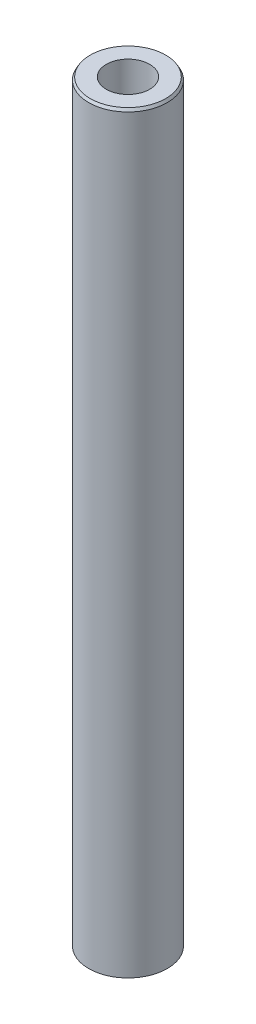
ISO-10303-21;
HEADER;
FILE_DESCRIPTION(('STEP AP214'),'2;1');
FILE_NAME('part.step','',(''),(''),'','','');
FILE_SCHEMA(('AUTOMOTIVE_DESIGN { 1 0 10303 214 1 1 1 1 }'));
ENDSEC;
DATA;
#1=APPLICATION_CONTEXT('core data for automotive mechanical design processes');
#2=APPLICATION_PROTOCOL_DEFINITION('international standard','automotive_design',2000,#1);
#3=PRODUCT_CONTEXT('',#1,'mechanical');
#4=PRODUCT('Part','Part','',(#3));
#5=PRODUCT_RELATED_PRODUCT_CATEGORY('part','',(#4));
#6=PRODUCT_DEFINITION_FORMATION('','',#4);
#7=PRODUCT_DEFINITION_CONTEXT('part definition',#1,'design');
#8=PRODUCT_DEFINITION('design','',#6,#7);
#9=PRODUCT_DEFINITION_SHAPE('','',#8);
#10=(LENGTH_UNIT() NAMED_UNIT(*) SI_UNIT(.MILLI.,.METRE.));
#11=(NAMED_UNIT(*) PLANE_ANGLE_UNIT() SI_UNIT($,.RADIAN.));
#12=(NAMED_UNIT(*) SI_UNIT($,.STERADIAN.) SOLID_ANGLE_UNIT());
#13=UNCERTAINTY_MEASURE_WITH_UNIT(LENGTH_MEASURE(1.E-05),#10,'distance_accuracy_value','');
#14=(GEOMETRIC_REPRESENTATION_CONTEXT(3) GLOBAL_UNCERTAINTY_ASSIGNED_CONTEXT((#13)) GLOBAL_UNIT_ASSIGNED_CONTEXT((#10,
#11,#12)) REPRESENTATION_CONTEXT('',''));
#15=CARTESIAN_POINT('',(0.,0.,0.));
#16=DIRECTION('',(0.,0.,1.));
#17=DIRECTION('',(1.,0.,0.));
#18=AXIS2_PLACEMENT_3D('',#15,#16,#17);
#19=CARTESIAN_POINT('',(0.,143.953407925919,0.));
#20=DIRECTION('',(0.,-1.,0.));
#21=DIRECTION('',(0.,0.,-1.));
#22=AXIS2_PLACEMENT_3D('',#19,#20,#21);
#23=CYLINDRICAL_SURFACE('',#22,7.5);
#24=CARTESIAN_POINT('',(0.,143.434430834139,0.));
#25=DIRECTION('',(0.,1.,0.));
#26=DIRECTION('',(0.,0.,1.));
#27=AXIS2_PLACEMENT_3D('',#24,#25,#26);
#28=CIRCLE('',#27,7.5);
#29=CARTESIAN_POINT('',(0.,143.434430834139,7.5));
#30=VERTEX_POINT('',#29);
#31=EDGE_CURVE('E50',#30,#30,#28,.F.);
#32=ORIENTED_EDGE('',*,*,#31,.T.);
#33=EDGE_LOOP('',(#32));
#34=FACE_BOUND('',#33,.T.);
#35=CARTESIAN_POINT('',(0.,0.299631563642433,0.));
#36=DIRECTION('',(0.,1.,0.));
#37=DIRECTION('',(0.,0.,1.));
#38=AXIS2_PLACEMENT_3D('',#35,#36,#37);
#39=CIRCLE('',#38,7.5);
#40=CARTESIAN_POINT('',(0.,0.299631563642433,7.5));
#41=VERTEX_POINT('',#40);
#42=EDGE_CURVE('E51',#41,#41,#39,.T.);
#43=ORIENTED_EDGE('',*,*,#42,.T.);
#44=EDGE_LOOP('',(#43));
#45=FACE_BOUND('',#44,.T.);
#46=ADVANCED_FACE('F39',(#34,#45),#23,.T.);
#47=CARTESIAN_POINT('',(0.,143.953407925919,0.));
#48=DIRECTION('',(0.,1.,0.));
#49=DIRECTION('',(0.,0.,1.));
#50=AXIS2_PLACEMENT_3D('',#47,#48,#49);
#51=PLANE('',#50);
#52=CARTESIAN_POINT('',(0.,143.953407925919,0.));
#53=DIRECTION('',(0.,1.,0.));
#54=DIRECTION('',(0.,0.,1.));
#55=AXIS2_PLACEMENT_3D('',#52,#53,#54);
#56=CIRCLE('',#55,7.20036843635749);
#57=CARTESIAN_POINT('',(0.,143.953407925919,7.20036843635749));
#58=VERTEX_POINT('',#57);
#59=EDGE_CURVE('E54',#58,#58,#56,.T.);
#60=ORIENTED_EDGE('',*,*,#59,.T.);
#61=EDGE_LOOP('',(#60));
#62=FACE_BOUND('',#61,.T.);
#63=CARTESIAN_POINT('',(0.,143.953407925919,0.));
#64=DIRECTION('',(0.,1.,0.));
#65=DIRECTION('',(0.,0.,1.));
#66=AXIS2_PLACEMENT_3D('',#63,#64,#65);
#67=CIRCLE('',#66,4.13896957339644);
#68=CARTESIAN_POINT('',(0.,143.953407925919,4.13896957339644));
#69=VERTEX_POINT('',#68);
#70=EDGE_CURVE('E58',#69,#69,#67,.T.);
#71=ORIENTED_EDGE('',*,*,#70,.F.);
#72=EDGE_LOOP('',(#71));
#73=FACE_BOUND('',#72,.T.);
#74=ADVANCED_FACE('F69',(#62,#73),#51,.T.);
#75=CARTESIAN_POINT('',(0.,0.,0.));
#76=DIRECTION('',(0.,1.,0.));
#77=DIRECTION('',(0.,0.,1.));
#78=AXIS2_PLACEMENT_3D('',#75,#76,#77);
#79=PLANE('',#78);
#80=CARTESIAN_POINT('',(0.,0.,0.));
#81=DIRECTION('',(0.,1.,0.));
#82=DIRECTION('',(0.,0.,1.));
#83=AXIS2_PLACEMENT_3D('',#80,#81,#82);
#84=CIRCLE('',#83,6.98102290821998);
#85=CARTESIAN_POINT('',(0.,0.,6.98102290821998));
#86=VERTEX_POINT('',#85);
#87=EDGE_CURVE('E10',#86,#86,#84,.F.);
#88=ORIENTED_EDGE('',*,*,#87,.T.);
#89=EDGE_LOOP('',(#88));
#90=FACE_BOUND('',#89,.T.);
#91=CARTESIAN_POINT('',(0.,0.,0.));
#92=DIRECTION('',(0.,1.,0.));
#93=DIRECTION('',(0.,0.,1.));
#94=AXIS2_PLACEMENT_3D('',#91,#92,#93);
#95=CIRCLE('',#94,4.13896957339644);
#96=CARTESIAN_POINT('',(0.,0.,4.13896957339644));
#97=VERTEX_POINT('',#96);
#98=EDGE_CURVE('E63',#97,#97,#95,.T.);
#99=ORIENTED_EDGE('',*,*,#98,.T.);
#100=EDGE_LOOP('',(#99));
#101=FACE_BOUND('',#100,.T.);
#102=ADVANCED_FACE('F75',(#90,#101),#79,.F.);
#103=CARTESIAN_POINT('',(0.,143.953407925919,0.));
#104=DIRECTION('',(0.,-1.,0.));
#105=DIRECTION('',(0.,0.,-1.));
#106=AXIS2_PLACEMENT_3D('',#103,#104,#105);
#107=CYLINDRICAL_SURFACE('',#106,4.13896957339644);
#108=ORIENTED_EDGE('',*,*,#70,.T.);
#109=EDGE_LOOP('',(#108));
#110=FACE_BOUND('',#109,.T.);
#111=ORIENTED_EDGE('',*,*,#98,.F.);
#112=EDGE_LOOP('',(#111));
#113=FACE_BOUND('',#112,.T.);
#114=ADVANCED_FACE('F70',(#110,#113),#107,.F.);
#115=CARTESIAN_POINT('',(0.,143.953407925919,0.));
#116=DIRECTION('',(0.,-1.,0.));
#117=DIRECTION('',(0.,0.,-1.));
#118=AXIS2_PLACEMENT_3D('',#115,#116,#117);
#119=CONICAL_SURFACE('',#118,7.20036843635749,0.523598775598314);
#120=ORIENTED_EDGE('',*,*,#31,.F.);
#121=EDGE_LOOP('',(#120));
#122=FACE_BOUND('',#121,.T.);
#123=ORIENTED_EDGE('',*,*,#59,.F.);
#124=EDGE_LOOP('',(#123));
#125=FACE_BOUND('',#124,.T.);
#126=ADVANCED_FACE('F81',(#122,#125),#119,.T.);
#127=CARTESIAN_POINT('',(0.,0.299631563642433,0.));
#128=DIRECTION('',(0.,1.,0.));
#129=DIRECTION('',(0.,0.,1.));
#130=AXIS2_PLACEMENT_3D('',#127,#128,#129);
#131=CONICAL_SURFACE('',#130,7.5,1.04719755119662);
#132=ORIENTED_EDGE('',*,*,#87,.F.);
#133=EDGE_LOOP('',(#132));
#134=FACE_BOUND('',#133,.T.);
#135=ORIENTED_EDGE('',*,*,#42,.F.);
#136=EDGE_LOOP('',(#135));
#137=FACE_BOUND('',#136,.T.);
#138=ADVANCED_FACE('F45',(#134,#137),#131,.T.);
#139=CLOSED_SHELL('',(#46,#74,#102,#114,#126,#138));
#140=MANIFOLD_SOLID_BREP('B2',#139);
#141=ADVANCED_BREP_SHAPE_REPRESENTATION('',(#18,#140),#14);
#142=SHAPE_DEFINITION_REPRESENTATION(#9,#141);
ENDSEC;
END-ISO-10303-21;
